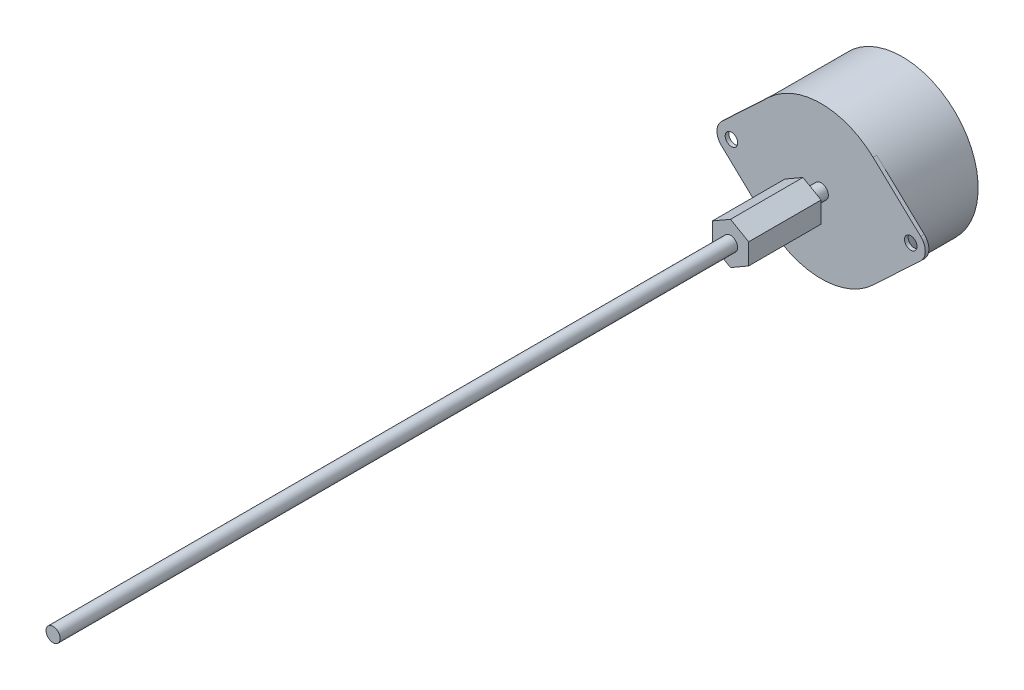
ISO-10303-21;
HEADER;
FILE_DESCRIPTION(('STEP AP214'),'2;1');
FILE_NAME('part.step','',(''),(''),'','','');
FILE_SCHEMA(('AUTOMOTIVE_DESIGN { 1 0 10303 214 1 1 1 1 }'));
ENDSEC;
DATA;
#1=APPLICATION_CONTEXT('core data for automotive mechanical design processes');
#2=APPLICATION_PROTOCOL_DEFINITION('international standard','automotive_design',2000,#1);
#3=PRODUCT_CONTEXT('',#1,'mechanical');
#4=PRODUCT('Part','Part','',(#3));
#5=PRODUCT_RELATED_PRODUCT_CATEGORY('part','',(#4));
#6=PRODUCT_DEFINITION_FORMATION('','',#4);
#7=PRODUCT_DEFINITION_CONTEXT('part definition',#1,'design');
#8=PRODUCT_DEFINITION('design','',#6,#7);
#9=PRODUCT_DEFINITION_SHAPE('','',#8);
#10=(LENGTH_UNIT() NAMED_UNIT(*) SI_UNIT(.MILLI.,.METRE.));
#11=(NAMED_UNIT(*) PLANE_ANGLE_UNIT() SI_UNIT($,.RADIAN.));
#12=(NAMED_UNIT(*) SI_UNIT($,.STERADIAN.) SOLID_ANGLE_UNIT());
#13=UNCERTAINTY_MEASURE_WITH_UNIT(LENGTH_MEASURE(1.E-05),#10,'distance_accuracy_value','');
#14=(GEOMETRIC_REPRESENTATION_CONTEXT(3) GLOBAL_UNCERTAINTY_ASSIGNED_CONTEXT((#13)) GLOBAL_UNIT_ASSIGNED_CONTEXT((#10,
#11,#12)) REPRESENTATION_CONTEXT('',''));
#15=CARTESIAN_POINT('',(0.,0.,0.));
#16=DIRECTION('',(0.,0.,1.));
#17=DIRECTION('',(1.,0.,0.));
#18=AXIS2_PLACEMENT_3D('',#15,#16,#17);
#19=CARTESIAN_POINT('',(0.,0.,-21.4));
#20=DIRECTION('',(0.,0.,1.));
#21=DIRECTION('',(1.,0.,0.));
#22=AXIS2_PLACEMENT_3D('',#19,#20,#21);
#23=PLANE('',#22);
#24=CARTESIAN_POINT('',(0.,0.,-21.4));
#25=DIRECTION('',(0.,0.,-1.));
#26=DIRECTION('',(1.,0.,0.));
#27=AXIS2_PLACEMENT_3D('',#24,#25,#26);
#28=CIRCLE('',#27,20.95);
#29=CARTESIAN_POINT('',(-20.95,0.,-21.4));
#30=VERTEX_POINT('',#29);
#31=EDGE_CURVE('E27',#30,#30,#28,.T.);
#32=ORIENTED_EDGE('',*,*,#31,.T.);
#33=EDGE_LOOP('',(#32));
#34=FACE_BOUND('',#33,.T.);
#35=ADVANCED_FACE('F16',(#34),#23,.F.);
#36=CARTESIAN_POINT('',(0.,0.,0.));
#37=DIRECTION('',(0.,0.,-1.));
#38=DIRECTION('',(1.,0.,0.));
#39=AXIS2_PLACEMENT_3D('',#36,#37,#38);
#40=CYLINDRICAL_SURFACE('',#39,20.95);
#41=ORIENTED_EDGE('',*,*,#31,.F.);
#42=DIRECTION('',(0.,0.,1.));
#43=VECTOR('',#42,1.);
#44=CARTESIAN_POINT('',(-20.95,0.,0.));
#45=LINE('',#44,#43);
#46=CARTESIAN_POINT('',(-20.95,0.,0.));
#47=VERTEX_POINT('',#46);
#48=EDGE_CURVE('E11',#30,#47,#45,.T.);
#49=ORIENTED_EDGE('',*,*,#48,.T.);
#50=CARTESIAN_POINT('',(0.,0.,0.));
#51=DIRECTION('',(0.,0.,1.));
#52=DIRECTION('',(1.,0.,0.));
#53=AXIS2_PLACEMENT_3D('',#50,#51,#52);
#54=CIRCLE('',#53,20.95);
#55=CARTESIAN_POINT('',(-14.3475757575758,15.2659611515497,0.));
#56=VERTEX_POINT('',#55);
#57=EDGE_CURVE('E304',#56,#47,#54,.T.);
#58=ORIENTED_EDGE('',*,*,#57,.F.);
#59=DIRECTION('',(0.,0.,1.));
#60=VECTOR('',#59,1.);
#61=CARTESIAN_POINT('',(-14.3475757575758,15.2659611515497,0.));
#62=LINE('',#61,#60);
#63=CARTESIAN_POINT('',(-14.3475757575758,15.2659611515497,1.));
#64=VERTEX_POINT('',#63);
#65=EDGE_CURVE('E197',#56,#64,#62,.T.);
#66=ORIENTED_EDGE('',*,*,#65,.T.);
#67=CARTESIAN_POINT('',(0.,0.,1.));
#68=DIRECTION('',(0.,0.,1.));
#69=DIRECTION('',(1.,0.,0.));
#70=AXIS2_PLACEMENT_3D('',#67,#68,#69);
#71=CIRCLE('',#70,20.95);
#72=CARTESIAN_POINT('',(14.3475757575758,15.2659611515497,1.));
#73=VERTEX_POINT('',#72);
#74=EDGE_CURVE('E327',#73,#64,#71,.T.);
#75=ORIENTED_EDGE('',*,*,#74,.F.);
#76=DIRECTION('',(0.,0.,1.));
#77=VECTOR('',#76,1.);
#78=CARTESIAN_POINT('',(14.3475757575758,15.2659611515497,0.));
#79=LINE('',#78,#77);
#80=CARTESIAN_POINT('',(14.3475757575758,15.2659611515497,0.));
#81=VERTEX_POINT('',#80);
#82=EDGE_CURVE('E311',#81,#73,#79,.T.);
#83=ORIENTED_EDGE('',*,*,#82,.F.);
#84=CARTESIAN_POINT('',(0.,0.,0.));
#85=DIRECTION('',(0.,0.,1.));
#86=DIRECTION('',(1.,0.,0.));
#87=AXIS2_PLACEMENT_3D('',#84,#85,#86);
#88=CIRCLE('',#87,20.95);
#89=CARTESIAN_POINT('',(14.3475757575758,-15.2659611515497,0.));
#90=VERTEX_POINT('',#89);
#91=EDGE_CURVE('E241',#90,#81,#88,.T.);
#92=ORIENTED_EDGE('',*,*,#91,.F.);
#93=DIRECTION('',(0.,0.,1.));
#94=VECTOR('',#93,1.);
#95=CARTESIAN_POINT('',(14.3475757575758,-15.2659611515497,0.));
#96=LINE('',#95,#94);
#97=CARTESIAN_POINT('',(14.3475757575758,-15.2659611515497,1.));
#98=VERTEX_POINT('',#97);
#99=EDGE_CURVE('E341',#90,#98,#96,.T.);
#100=ORIENTED_EDGE('',*,*,#99,.T.);
#101=CARTESIAN_POINT('',(0.,0.,1.));
#102=DIRECTION('',(0.,0.,1.));
#103=DIRECTION('',(1.,0.,0.));
#104=AXIS2_PLACEMENT_3D('',#101,#102,#103);
#105=CIRCLE('',#104,20.95);
#106=CARTESIAN_POINT('',(-14.3475757575758,-15.2659611515497,1.));
#107=VERTEX_POINT('',#106);
#108=EDGE_CURVE('E308',#107,#98,#105,.T.);
#109=ORIENTED_EDGE('',*,*,#108,.F.);
#110=DIRECTION('',(0.,0.,1.));
#111=VECTOR('',#110,1.);
#112=CARTESIAN_POINT('',(-14.3475757575758,-15.2659611515497,0.));
#113=LINE('',#112,#111);
#114=CARTESIAN_POINT('',(-14.3475757575758,-15.2659611515497,0.));
#115=VERTEX_POINT('',#114);
#116=EDGE_CURVE('E353',#115,#107,#113,.T.);
#117=ORIENTED_EDGE('',*,*,#116,.F.);
#118=CARTESIAN_POINT('',(0.,0.,0.));
#119=DIRECTION('',(0.,0.,1.));
#120=DIRECTION('',(1.,0.,0.));
#121=AXIS2_PLACEMENT_3D('',#118,#119,#120);
#122=CIRCLE('',#121,20.95);
#123=EDGE_CURVE('E307',#47,#115,#122,.T.);
#124=ORIENTED_EDGE('',*,*,#123,.F.);
#125=ORIENTED_EDGE('',*,*,#48,.F.);
#126=EDGE_LOOP('',(#41,#49,#58,#66,#75,#83,#92,#100,#109,#117,#124,#125));
#127=FACE_BOUND('',#126,.T.);
#128=ADVANCED_FACE('F433',(#127),#40,.T.);
#129=CARTESIAN_POINT('',(0.,0.,0.));
#130=DIRECTION('',(0.,0.,1.));
#131=DIRECTION('',(1.,0.,0.));
#132=AXIS2_PLACEMENT_3D('',#129,#130,#131);
#133=PLANE('',#132);
#134=CARTESIAN_POINT('',(-24.75,0.,0.));
#135=DIRECTION('',(0.,0.,-1.));
#136=DIRECTION('',(1.,0.,0.));
#137=AXIS2_PLACEMENT_3D('',#134,#135,#136);
#138=CIRCLE('',#137,1.725);
#139=CARTESIAN_POINT('',(-26.475,0.,0.));
#140=VERTEX_POINT('',#139);
#141=EDGE_CURVE('E276',#140,#140,#138,.T.);
#142=ORIENTED_EDGE('',*,*,#141,.F.);
#143=EDGE_LOOP('',(#142));
#144=FACE_BOUND('',#143,.T.);
#145=ORIENTED_EDGE('',*,*,#57,.T.);
#146=ORIENTED_EDGE('',*,*,#123,.T.);
#147=DIRECTION('',(0.728685496494019,-0.684848484848485,0.));
#148=VECTOR('',#147,1.);
#149=CARTESIAN_POINT('',(-27.4893939393939,-2.91474198597608,0.));
#150=LINE('',#149,#148);
#151=CARTESIAN_POINT('',(-27.4893939393939,-2.91474198597608,0.));
#152=VERTEX_POINT('',#151);
#153=EDGE_CURVE('E215',#152,#115,#150,.T.);
#154=ORIENTED_EDGE('',*,*,#153,.F.);
#155=CARTESIAN_POINT('',(-24.75,0.,0.));
#156=DIRECTION('',(0.,0.,1.));
#157=DIRECTION('',(-0.684848484848484,0.72868549649402,0.));
#158=AXIS2_PLACEMENT_3D('',#155,#156,#157);
#159=CIRCLE('',#158,4.);
#160=CARTESIAN_POINT('',(-27.4893939393939,2.91474198597607,0.));
#161=VERTEX_POINT('',#160);
#162=EDGE_CURVE('E207',#161,#152,#159,.T.);
#163=ORIENTED_EDGE('',*,*,#162,.F.);
#164=DIRECTION('',(-0.728685496494019,-0.684848484848485,0.));
#165=VECTOR('',#164,1.);
#166=CARTESIAN_POINT('',(-14.3475757575758,15.2659611515497,0.));
#167=LINE('',#166,#165);
#168=EDGE_CURVE('E190',#56,#161,#167,.T.);
#169=ORIENTED_EDGE('',*,*,#168,.F.);
#170=EDGE_LOOP('',(#145,#146,#154,#163,#169));
#171=FACE_BOUND('',#170,.T.);
#172=ADVANCED_FACE('F213',(#144,#171),#133,.F.);
#173=CARTESIAN_POINT('',(0.,0.,1.));
#174=DIRECTION('',(0.,0.,1.));
#175=DIRECTION('',(1.,0.,0.));
#176=AXIS2_PLACEMENT_3D('',#173,#174,#175);
#177=PLANE('',#176);
#178=CARTESIAN_POINT('',(24.75,0.,1.));
#179=DIRECTION('',(0.,0.,-1.));
#180=DIRECTION('',(1.,0.,0.));
#181=AXIS2_PLACEMENT_3D('',#178,#179,#180);
#182=CIRCLE('',#181,1.725);
#183=CARTESIAN_POINT('',(23.025,0.,1.));
#184=VERTEX_POINT('',#183);
#185=EDGE_CURVE('E322',#184,#184,#182,.T.);
#186=ORIENTED_EDGE('',*,*,#185,.T.);
#187=EDGE_LOOP('',(#186));
#188=FACE_BOUND('',#187,.T.);
#189=CARTESIAN_POINT('',(-24.75,0.,1.));
#190=DIRECTION('',(0.,0.,-1.));
#191=DIRECTION('',(1.,0.,0.));
#192=AXIS2_PLACEMENT_3D('',#189,#190,#191);
#193=CIRCLE('',#192,1.725);
#194=CARTESIAN_POINT('',(-26.475,0.,1.));
#195=VERTEX_POINT('',#194);
#196=EDGE_CURVE('E277',#195,#195,#193,.T.);
#197=ORIENTED_EDGE('',*,*,#196,.T.);
#198=EDGE_LOOP('',(#197));
#199=FACE_BOUND('',#198,.T.);
#200=CARTESIAN_POINT('',(0.,0.,1.));
#201=DIRECTION('',(0.,0.,-1.));
#202=DIRECTION('',(1.,0.,0.));
#203=AXIS2_PLACEMENT_3D('',#200,#201,#202);
#204=CIRCLE('',#203,2.);
#205=CARTESIAN_POINT('',(-2.,0.,1.));
#206=VERTEX_POINT('',#205);
#207=EDGE_CURVE('E292',#206,#206,#204,.T.);
#208=ORIENTED_EDGE('',*,*,#207,.T.);
#209=EDGE_LOOP('',(#208));
#210=FACE_BOUND('',#209,.T.);
#211=ORIENTED_EDGE('',*,*,#74,.T.);
#212=DIRECTION('',(-0.728685496494019,-0.684848484848485,0.));
#213=VECTOR('',#212,1.);
#214=CARTESIAN_POINT('',(-14.3475757575758,15.2659611515497,1.));
#215=LINE('',#214,#213);
#216=CARTESIAN_POINT('',(-27.4893939393939,2.91474198597607,1.));
#217=VERTEX_POINT('',#216);
#218=EDGE_CURVE('E202',#64,#217,#215,.T.);
#219=ORIENTED_EDGE('',*,*,#218,.T.);
#220=CARTESIAN_POINT('',(-24.75,0.,1.));
#221=DIRECTION('',(0.,0.,1.));
#222=DIRECTION('',(-0.684848484848484,0.72868549649402,0.));
#223=AXIS2_PLACEMENT_3D('',#220,#221,#222);
#224=CIRCLE('',#223,4.);
#225=CARTESIAN_POINT('',(-27.4893939393939,-2.91474198597608,1.));
#226=VERTEX_POINT('',#225);
#227=EDGE_CURVE('E209',#217,#226,#224,.T.);
#228=ORIENTED_EDGE('',*,*,#227,.T.);
#229=DIRECTION('',(0.728685496494019,-0.684848484848485,0.));
#230=VECTOR('',#229,1.);
#231=CARTESIAN_POINT('',(-27.4893939393939,-2.91474198597608,1.));
#232=LINE('',#231,#230);
#233=EDGE_CURVE('E225',#226,#107,#232,.T.);
#234=ORIENTED_EDGE('',*,*,#233,.T.);
#235=ORIENTED_EDGE('',*,*,#108,.T.);
#236=DIRECTION('',(0.728685496494019,0.684848484848485,0.));
#237=VECTOR('',#236,1.);
#238=CARTESIAN_POINT('',(27.4893939393939,-2.91474198597608,1.));
#239=LINE('',#238,#237);
#240=CARTESIAN_POINT('',(27.4893939393939,-2.91474198597608,1.));
#241=VERTEX_POINT('',#240);
#242=EDGE_CURVE('E270',#98,#241,#239,.T.);
#243=ORIENTED_EDGE('',*,*,#242,.T.);
#244=CARTESIAN_POINT('',(24.75,0.,1.));
#245=DIRECTION('',(0.,0.,1.));
#246=DIRECTION('',(0.684848484848484,-0.72868549649402,0.));
#247=AXIS2_PLACEMENT_3D('',#244,#245,#246);
#248=CIRCLE('',#247,4.);
#249=CARTESIAN_POINT('',(27.4893939393939,2.91474198597607,1.));
#250=VERTEX_POINT('',#249);
#251=EDGE_CURVE('E271',#241,#250,#248,.T.);
#252=ORIENTED_EDGE('',*,*,#251,.T.);
#253=DIRECTION('',(-0.728685496494019,0.684848484848485,0.));
#254=VECTOR('',#253,1.);
#255=CARTESIAN_POINT('',(14.3475757575758,15.2659611515497,1.));
#256=LINE('',#255,#254);
#257=EDGE_CURVE('E328',#250,#73,#256,.T.);
#258=ORIENTED_EDGE('',*,*,#257,.T.);
#259=EDGE_LOOP('',(#211,#219,#228,#234,#235,#243,#252,#258));
#260=FACE_BOUND('',#259,.T.);
#261=ADVANCED_FACE('F474',(#188,#199,#210,#260),#177,.T.);
#262=CARTESIAN_POINT('',(-14.3475757575758,15.2659611515497,0.));
#263=DIRECTION('',(-0.684848484848485,0.728685496494019,0.));
#264=DIRECTION('',(0.,0.,1.));
#265=AXIS2_PLACEMENT_3D('',#262,#263,#264);
#266=PLANE('',#265);
#267=ORIENTED_EDGE('',*,*,#168,.T.);
#268=DIRECTION('',(0.,0.,1.));
#269=VECTOR('',#268,1.);
#270=CARTESIAN_POINT('',(-27.4893939393939,2.91474198597607,0.));
#271=LINE('',#270,#269);
#272=EDGE_CURVE('E194',#161,#217,#271,.T.);
#273=ORIENTED_EDGE('',*,*,#272,.T.);
#274=ORIENTED_EDGE('',*,*,#218,.F.);
#275=ORIENTED_EDGE('',*,*,#65,.F.);
#276=EDGE_LOOP('',(#267,#273,#274,#275));
#277=FACE_BOUND('',#276,.T.);
#278=ADVANCED_FACE('F192',(#277),#266,.T.);
#279=CARTESIAN_POINT('',(-24.75,0.,0.));
#280=DIRECTION('',(0.,0.,1.));
#281=DIRECTION('',(-0.684848484848484,0.72868549649402,0.));
#282=AXIS2_PLACEMENT_3D('',#279,#280,#281);
#283=CYLINDRICAL_SURFACE('',#282,4.);
#284=ORIENTED_EDGE('',*,*,#162,.T.);
#285=DIRECTION('',(0.,0.,1.));
#286=VECTOR('',#285,1.);
#287=CARTESIAN_POINT('',(-27.4893939393939,-2.91474198597608,0.));
#288=LINE('',#287,#286);
#289=EDGE_CURVE('E217',#152,#226,#288,.T.);
#290=ORIENTED_EDGE('',*,*,#289,.T.);
#291=ORIENTED_EDGE('',*,*,#227,.F.);
#292=ORIENTED_EDGE('',*,*,#272,.F.);
#293=EDGE_LOOP('',(#284,#290,#291,#292));
#294=FACE_BOUND('',#293,.T.);
#295=ADVANCED_FACE('F205',(#294),#283,.T.);
#296=CARTESIAN_POINT('',(-27.4893939393939,-2.91474198597608,0.));
#297=DIRECTION('',(-0.684848484848485,-0.728685496494019,0.));
#298=DIRECTION('',(-0.728685496494019,0.684848484848485,0.));
#299=AXIS2_PLACEMENT_3D('',#296,#297,#298);
#300=PLANE('',#299);
#301=ORIENTED_EDGE('',*,*,#153,.T.);
#302=ORIENTED_EDGE('',*,*,#116,.T.);
#303=ORIENTED_EDGE('',*,*,#233,.F.);
#304=ORIENTED_EDGE('',*,*,#289,.F.);
#305=EDGE_LOOP('',(#301,#302,#303,#304));
#306=FACE_BOUND('',#305,.T.);
#307=ADVANCED_FACE('F478',(#306),#300,.T.);
#308=CARTESIAN_POINT('',(14.3475757575758,-15.2659611515497,0.));
#309=DIRECTION('',(0.684848484848485,-0.728685496494019,0.));
#310=DIRECTION('',(0.,0.,-1.));
#311=AXIS2_PLACEMENT_3D('',#308,#309,#310);
#312=PLANE('',#311);
#313=DIRECTION('',(-0.728685496494019,-0.684848484848485,0.));
#314=VECTOR('',#313,1.);
#315=CARTESIAN_POINT('',(27.4893939393939,-2.91474198597608,0.));
#316=LINE('',#315,#314);
#317=CARTESIAN_POINT('',(27.4893939393939,-2.91474198597608,0.));
#318=VERTEX_POINT('',#317);
#319=EDGE_CURVE('E287',#318,#90,#316,.T.);
#320=ORIENTED_EDGE('',*,*,#319,.F.);
#321=DIRECTION('',(0.,0.,1.));
#322=VECTOR('',#321,1.);
#323=CARTESIAN_POINT('',(27.4893939393939,-2.91474198597608,0.));
#324=LINE('',#323,#322);
#325=EDGE_CURVE('E266',#318,#241,#324,.T.);
#326=ORIENTED_EDGE('',*,*,#325,.T.);
#327=ORIENTED_EDGE('',*,*,#242,.F.);
#328=ORIENTED_EDGE('',*,*,#99,.F.);
#329=EDGE_LOOP('',(#320,#326,#327,#328));
#330=FACE_BOUND('',#329,.T.);
#331=ADVANCED_FACE('F476',(#330),#312,.T.);
#332=CARTESIAN_POINT('',(24.75,0.,0.));
#333=DIRECTION('',(0.,0.,1.));
#334=DIRECTION('',(0.684848484848484,-0.72868549649402,0.));
#335=AXIS2_PLACEMENT_3D('',#332,#333,#334);
#336=CYLINDRICAL_SURFACE('',#335,4.);
#337=CARTESIAN_POINT('',(24.75,0.,0.));
#338=DIRECTION('',(0.,0.,1.));
#339=DIRECTION('',(0.684848484848484,-0.72868549649402,0.));
#340=AXIS2_PLACEMENT_3D('',#337,#338,#339);
#341=CIRCLE('',#340,4.);
#342=CARTESIAN_POINT('',(27.4893939393939,2.91474198597607,0.));
#343=VERTEX_POINT('',#342);
#344=EDGE_CURVE('E240',#318,#343,#341,.T.);
#345=ORIENTED_EDGE('',*,*,#344,.T.);
#346=DIRECTION('',(0.,0.,1.));
#347=VECTOR('',#346,1.);
#348=CARTESIAN_POINT('',(27.4893939393939,2.91474198597607,0.));
#349=LINE('',#348,#347);
#350=EDGE_CURVE('E319',#343,#250,#349,.T.);
#351=ORIENTED_EDGE('',*,*,#350,.T.);
#352=ORIENTED_EDGE('',*,*,#251,.F.);
#353=ORIENTED_EDGE('',*,*,#325,.F.);
#354=EDGE_LOOP('',(#345,#351,#352,#353));
#355=FACE_BOUND('',#354,.T.);
#356=ADVANCED_FACE('F428',(#355),#336,.T.);
#357=CARTESIAN_POINT('',(27.4893939393939,2.91474198597608,0.));
#358=DIRECTION('',(0.684848484848485,0.728685496494019,0.));
#359=DIRECTION('',(0.,0.,-1.));
#360=AXIS2_PLACEMENT_3D('',#357,#358,#359);
#361=PLANE('',#360);
#362=DIRECTION('',(0.728685496494019,-0.684848484848485,0.));
#363=VECTOR('',#362,1.);
#364=CARTESIAN_POINT('',(14.3475757575758,15.2659611515497,0.));
#365=LINE('',#364,#363);
#366=EDGE_CURVE('E236',#81,#343,#365,.T.);
#367=ORIENTED_EDGE('',*,*,#366,.F.);
#368=ORIENTED_EDGE('',*,*,#82,.T.);
#369=ORIENTED_EDGE('',*,*,#257,.F.);
#370=ORIENTED_EDGE('',*,*,#350,.F.);
#371=EDGE_LOOP('',(#367,#368,#369,#370));
#372=FACE_BOUND('',#371,.T.);
#373=ADVANCED_FACE('F424',(#372),#361,.T.);
#374=CARTESIAN_POINT('',(-24.75,0.,0.));
#375=DIRECTION('',(0.,0.,1.));
#376=DIRECTION('',(1.,0.,0.));
#377=AXIS2_PLACEMENT_3D('',#374,#375,#376);
#378=CYLINDRICAL_SURFACE('',#377,1.725);
#379=ORIENTED_EDGE('',*,*,#196,.F.);
#380=DIRECTION('',(0.,0.,-1.));
#381=VECTOR('',#380,1.);
#382=CARTESIAN_POINT('',(-26.475,0.,0.));
#383=LINE('',#382,#381);
#384=EDGE_CURVE('E153',#195,#140,#383,.T.);
#385=ORIENTED_EDGE('',*,*,#384,.T.);
#386=ORIENTED_EDGE('',*,*,#141,.T.);
#387=ORIENTED_EDGE('',*,*,#384,.F.);
#388=EDGE_LOOP('',(#379,#385,#386,#387));
#389=FACE_BOUND('',#388,.T.);
#390=ADVANCED_FACE('F497',(#389),#378,.F.);
#391=CARTESIAN_POINT('',(24.75,0.,0.));
#392=DIRECTION('',(0.,0.,1.));
#393=DIRECTION('',(1.,0.,0.));
#394=AXIS2_PLACEMENT_3D('',#391,#392,#393);
#395=CYLINDRICAL_SURFACE('',#394,1.725);
#396=ORIENTED_EDGE('',*,*,#185,.F.);
#397=DIRECTION('',(0.,0.,-1.));
#398=VECTOR('',#397,1.);
#399=CARTESIAN_POINT('',(23.025,0.,0.));
#400=LINE('',#399,#398);
#401=CARTESIAN_POINT('',(23.025,0.,0.));
#402=VERTEX_POINT('',#401);
#403=EDGE_CURVE('E140',#184,#402,#400,.T.);
#404=ORIENTED_EDGE('',*,*,#403,.T.);
#405=CARTESIAN_POINT('',(24.75,0.,0.));
#406=DIRECTION('',(0.,0.,-1.));
#407=DIRECTION('',(1.,0.,0.));
#408=AXIS2_PLACEMENT_3D('',#405,#406,#407);
#409=CIRCLE('',#408,1.725);
#410=EDGE_CURVE('E291',#402,#402,#409,.T.);
#411=ORIENTED_EDGE('',*,*,#410,.T.);
#412=ORIENTED_EDGE('',*,*,#403,.F.);
#413=EDGE_LOOP('',(#396,#404,#411,#412));
#414=FACE_BOUND('',#413,.T.);
#415=ADVANCED_FACE('F499',(#414),#395,.F.);
#416=CARTESIAN_POINT('',(0.,0.,0.));
#417=DIRECTION('',(0.,0.,1.));
#418=DIRECTION('',(1.,0.,0.));
#419=AXIS2_PLACEMENT_3D('',#416,#417,#418);
#420=PLANE('',#419);
#421=ORIENTED_EDGE('',*,*,#410,.F.);
#422=EDGE_LOOP('',(#421));
#423=FACE_BOUND('',#422,.T.);
#424=ORIENTED_EDGE('',*,*,#91,.T.);
#425=ORIENTED_EDGE('',*,*,#366,.T.);
#426=ORIENTED_EDGE('',*,*,#344,.F.);
#427=ORIENTED_EDGE('',*,*,#319,.T.);
#428=EDGE_LOOP('',(#424,#425,#426,#427));
#429=FACE_BOUND('',#428,.T.);
#430=ADVANCED_FACE('F431',(#423,#429),#420,.F.);
#431=CARTESIAN_POINT('',(0.,0.,213.));
#432=DIRECTION('',(0.,0.,1.));
#433=DIRECTION('',(1.,0.,0.));
#434=AXIS2_PLACEMENT_3D('',#431,#432,#433);
#435=PLANE('',#434);
#436=CARTESIAN_POINT('',(0.,0.,213.));
#437=DIRECTION('',(0.,0.,1.));
#438=DIRECTION('',(1.,0.,0.));
#439=AXIS2_PLACEMENT_3D('',#436,#437,#438);
#440=CIRCLE('',#439,1.954);
#441=CARTESIAN_POINT('',(-1.954,0.,213.));
#442=VERTEX_POINT('',#441);
#443=EDGE_CURVE('E295',#442,#442,#440,.T.);
#444=ORIENTED_EDGE('',*,*,#443,.T.);
#445=EDGE_LOOP('',(#444));
#446=FACE_BOUND('',#445,.T.);
#447=ADVANCED_FACE('F532',(#446),#435,.T.);
#448=CARTESIAN_POINT('',(0.,0.,1.));
#449=DIRECTION('',(0.,0.,1.));
#450=DIRECTION('',(1.,0.,0.));
#451=AXIS2_PLACEMENT_3D('',#448,#449,#450);
#452=CYLINDRICAL_SURFACE('',#451,1.954);
#453=ORIENTED_EDGE('',*,*,#443,.F.);
#454=DIRECTION('',(0.,0.,-1.));
#455=VECTOR('',#454,1.);
#456=CARTESIAN_POINT('',(-1.954,0.,1.));
#457=LINE('',#456,#455);
#458=CARTESIAN_POINT('',(-1.954,0.,26.));
#459=VERTEX_POINT('',#458);
#460=EDGE_CURVE('E345',#442,#459,#457,.T.);
#461=ORIENTED_EDGE('',*,*,#460,.T.);
#462=CARTESIAN_POINT('',(0.,0.,26.));
#463=DIRECTION('',(0.,0.,1.));
#464=DIRECTION('',(1.,0.,0.));
#465=AXIS2_PLACEMENT_3D('',#462,#463,#464);
#466=CIRCLE('',#465,1.954);
#467=EDGE_CURVE('E242',#459,#459,#466,.T.);
#468=ORIENTED_EDGE('',*,*,#467,.T.);
#469=ORIENTED_EDGE('',*,*,#460,.F.);
#470=EDGE_LOOP('',(#453,#461,#468,#469));
#471=FACE_BOUND('',#470,.T.);
#472=ADVANCED_FACE('F525',(#471),#452,.T.);
#473=CARTESIAN_POINT('',(0.,0.,1.));
#474=DIRECTION('',(0.,0.,1.));
#475=DIRECTION('',(1.,0.,0.));
#476=AXIS2_PLACEMENT_3D('',#473,#474,#475);
#477=CYLINDRICAL_SURFACE('',#476,2.);
#478=CARTESIAN_POINT('',(0.,0.,6.));
#479=DIRECTION('',(0.,0.,-1.));
#480=DIRECTION('',(1.,0.,0.));
#481=AXIS2_PLACEMENT_3D('',#478,#479,#480);
#482=CIRCLE('',#481,2.);
#483=CARTESIAN_POINT('',(-2.,0.,6.));
#484=VERTEX_POINT('',#483);
#485=EDGE_CURVE('E246',#484,#484,#482,.T.);
#486=ORIENTED_EDGE('',*,*,#485,.T.);
#487=DIRECTION('',(0.,0.,-1.));
#488=VECTOR('',#487,1.);
#489=CARTESIAN_POINT('',(-2.,0.,1.));
#490=LINE('',#489,#488);
#491=EDGE_CURVE('E254',#484,#206,#490,.T.);
#492=ORIENTED_EDGE('',*,*,#491,.T.);
#493=ORIENTED_EDGE('',*,*,#207,.F.);
#494=ORIENTED_EDGE('',*,*,#491,.F.);
#495=EDGE_LOOP('',(#486,#492,#493,#494));
#496=FACE_BOUND('',#495,.T.);
#497=ADVANCED_FACE('F512',(#496),#477,.T.);
#498=CARTESIAN_POINT('',(0.,0.,6.));
#499=DIRECTION('',(0.,0.,1.));
#500=DIRECTION('',(1.,0.,0.));
#501=AXIS2_PLACEMENT_3D('',#498,#499,#500);
#502=PLANE('',#501);
#503=ORIENTED_EDGE('',*,*,#485,.F.);
#504=EDGE_LOOP('',(#503));
#505=FACE_BOUND('',#504,.T.);
#506=DIRECTION('',(-0.866025403784439,-0.5,0.));
#507=VECTOR('',#506,1.);
#508=CARTESIAN_POINT('',(1.25,-5.05181485540923,6.));
#509=LINE('',#508,#507);
#510=CARTESIAN_POINT('',(5.,-2.88675134594813,6.));
#511=VERTEX_POINT('',#510);
#512=CARTESIAN_POINT('',(0.,-5.77350269189626,6.));
#513=VERTEX_POINT('',#512);
#514=EDGE_CURVE('E265',#511,#513,#509,.T.);
#515=ORIENTED_EDGE('',*,*,#514,.T.);
#516=DIRECTION('',(-0.866025403784439,0.5,0.));
#517=VECTOR('',#516,1.);
#518=CARTESIAN_POINT('',(-3.75,-3.60843918243516,6.));
#519=LINE('',#518,#517);
#520=CARTESIAN_POINT('',(-5.,-2.88675134594813,6.));
#521=VERTEX_POINT('',#520);
#522=EDGE_CURVE('E251',#513,#521,#519,.T.);
#523=ORIENTED_EDGE('',*,*,#522,.T.);
#524=DIRECTION('',(0.,1.,0.));
#525=VECTOR('',#524,1.);
#526=CARTESIAN_POINT('',(-5.,1.44337567297406,6.));
#527=LINE('',#526,#525);
#528=CARTESIAN_POINT('',(-5.,2.88675134594813,6.));
#529=VERTEX_POINT('',#528);
#530=EDGE_CURVE('E279',#521,#529,#527,.T.);
#531=ORIENTED_EDGE('',*,*,#530,.T.);
#532=DIRECTION('',(0.866025403784438,0.5,0.));
#533=VECTOR('',#532,1.);
#534=CARTESIAN_POINT('',(-1.25,5.05181485540923,6.));
#535=LINE('',#534,#533);
#536=CARTESIAN_POINT('',(0.,5.77350269189626,6.));
#537=VERTEX_POINT('',#536);
#538=EDGE_CURVE('E296',#529,#537,#535,.T.);
#539=ORIENTED_EDGE('',*,*,#538,.T.);
#540=DIRECTION('',(0.866025403784439,-0.5,0.));
#541=VECTOR('',#540,1.);
#542=CARTESIAN_POINT('',(3.75,3.60843918243516,6.));
#543=LINE('',#542,#541);
#544=CARTESIAN_POINT('',(5.,2.88675134594813,6.));
#545=VERTEX_POINT('',#544);
#546=EDGE_CURVE('E256',#537,#545,#543,.T.);
#547=ORIENTED_EDGE('',*,*,#546,.T.);
#548=DIRECTION('',(0.,-1.,0.));
#549=VECTOR('',#548,1.);
#550=CARTESIAN_POINT('',(5.,-1.44337567297406,6.));
#551=LINE('',#550,#549);
#552=EDGE_CURVE('E335',#545,#511,#551,.T.);
#553=ORIENTED_EDGE('',*,*,#552,.T.);
#554=EDGE_LOOP('',(#515,#523,#531,#539,#547,#553));
#555=FACE_BOUND('',#554,.T.);
#556=ADVANCED_FACE('F398',(#505,#555),#502,.F.);
#557=CARTESIAN_POINT('',(0.,0.,26.));
#558=DIRECTION('',(0.,0.,1.));
#559=DIRECTION('',(1.,0.,0.));
#560=AXIS2_PLACEMENT_3D('',#557,#558,#559);
#561=PLANE('',#560);
#562=ORIENTED_EDGE('',*,*,#467,.F.);
#563=EDGE_LOOP('',(#562));
#564=FACE_BOUND('',#563,.T.);
#565=DIRECTION('',(0.866025403784439,0.5,0.));
#566=VECTOR('',#565,1.);
#567=CARTESIAN_POINT('',(1.25,-5.05181485540923,26.));
#568=LINE('',#567,#566);
#569=CARTESIAN_POINT('',(0.,-5.77350269189626,26.));
#570=VERTEX_POINT('',#569);
#571=CARTESIAN_POINT('',(5.,-2.88675134594813,26.));
#572=VERTEX_POINT('',#571);
#573=EDGE_CURVE('E247',#570,#572,#568,.T.);
#574=ORIENTED_EDGE('',*,*,#573,.T.);
#575=DIRECTION('',(0.,1.,0.));
#576=VECTOR('',#575,1.);
#577=CARTESIAN_POINT('',(5.,-1.44337567297406,26.));
#578=LINE('',#577,#576);
#579=CARTESIAN_POINT('',(5.,2.88675134594813,26.));
#580=VERTEX_POINT('',#579);
#581=EDGE_CURVE('E20',#572,#580,#578,.T.);
#582=ORIENTED_EDGE('',*,*,#581,.T.);
#583=DIRECTION('',(-0.866025403784439,0.5,0.));
#584=VECTOR('',#583,1.);
#585=CARTESIAN_POINT('',(3.75,3.60843918243516,26.));
#586=LINE('',#585,#584);
#587=CARTESIAN_POINT('',(0.,5.77350269189626,26.));
#588=VERTEX_POINT('',#587);
#589=EDGE_CURVE('E260',#580,#588,#586,.T.);
#590=ORIENTED_EDGE('',*,*,#589,.T.);
#591=DIRECTION('',(-0.866025403784438,-0.5,0.));
#592=VECTOR('',#591,1.);
#593=CARTESIAN_POINT('',(-1.25,5.05181485540923,26.));
#594=LINE('',#593,#592);
#595=CARTESIAN_POINT('',(-5.,2.88675134594813,26.));
#596=VERTEX_POINT('',#595);
#597=EDGE_CURVE('E229',#588,#596,#594,.T.);
#598=ORIENTED_EDGE('',*,*,#597,.T.);
#599=DIRECTION('',(0.,-1.,0.));
#600=VECTOR('',#599,1.);
#601=CARTESIAN_POINT('',(-5.,1.44337567297406,26.));
#602=LINE('',#601,#600);
#603=CARTESIAN_POINT('',(-5.,-2.88675134594813,26.));
#604=VERTEX_POINT('',#603);
#605=EDGE_CURVE('E283',#596,#604,#602,.T.);
#606=ORIENTED_EDGE('',*,*,#605,.T.);
#607=DIRECTION('',(0.866025403784439,-0.5,0.));
#608=VECTOR('',#607,1.);
#609=CARTESIAN_POINT('',(-3.75,-3.60843918243516,26.));
#610=LINE('',#609,#608);
#611=EDGE_CURVE('E230',#604,#570,#610,.T.);
#612=ORIENTED_EDGE('',*,*,#611,.T.);
#613=EDGE_LOOP('',(#574,#582,#590,#598,#606,#612));
#614=FACE_BOUND('',#613,.T.);
#615=ADVANCED_FACE('F516',(#564,#614),#561,.T.);
#616=CARTESIAN_POINT('',(0.,-5.77350269189626,6.));
#617=DIRECTION('',(0.5,-0.866025403784439,0.));
#618=DIRECTION('',(0.,0.,-1.));
#619=AXIS2_PLACEMENT_3D('',#616,#617,#618);
#620=PLANE('',#619);
#621=ORIENTED_EDGE('',*,*,#514,.F.);
#622=DIRECTION('',(0.,0.,1.));
#623=VECTOR('',#622,1.);
#624=CARTESIAN_POINT('',(5.,-2.88675134594813,6.));
#625=LINE('',#624,#623);
#626=EDGE_CURVE('E300',#511,#572,#625,.T.);
#627=ORIENTED_EDGE('',*,*,#626,.T.);
#628=ORIENTED_EDGE('',*,*,#573,.F.);
#629=DIRECTION('',(0.,0.,1.));
#630=VECTOR('',#629,1.);
#631=CARTESIAN_POINT('',(0.,-5.77350269189626,6.));
#632=LINE('',#631,#630);
#633=EDGE_CURVE('E235',#513,#570,#632,.T.);
#634=ORIENTED_EDGE('',*,*,#633,.F.);
#635=EDGE_LOOP('',(#621,#627,#628,#634));
#636=FACE_BOUND('',#635,.T.);
#637=ADVANCED_FACE('F522',(#636),#620,.T.);
#638=CARTESIAN_POINT('',(5.,-2.88675134594813,6.));
#639=DIRECTION('',(1.,0.,0.));
#640=DIRECTION('',(0.,1.,0.));
#641=AXIS2_PLACEMENT_3D('',#638,#639,#640);
#642=PLANE('',#641);
#643=ORIENTED_EDGE('',*,*,#552,.F.);
#644=DIRECTION('',(0.,0.,1.));
#645=VECTOR('',#644,1.);
#646=CARTESIAN_POINT('',(5.,2.88675134594813,6.));
#647=LINE('',#646,#645);
#648=EDGE_CURVE('E274',#545,#580,#647,.T.);
#649=ORIENTED_EDGE('',*,*,#648,.T.);
#650=ORIENTED_EDGE('',*,*,#581,.F.);
#651=ORIENTED_EDGE('',*,*,#626,.F.);
#652=EDGE_LOOP('',(#643,#649,#650,#651));
#653=FACE_BOUND('',#652,.T.);
#654=ADVANCED_FACE('F529',(#653),#642,.T.);
#655=CARTESIAN_POINT('',(5.,2.88675134594813,6.));
#656=DIRECTION('',(0.5,0.866025403784439,0.));
#657=DIRECTION('',(0.,0.,-1.));
#658=AXIS2_PLACEMENT_3D('',#655,#656,#657);
#659=PLANE('',#658);
#660=ORIENTED_EDGE('',*,*,#546,.F.);
#661=DIRECTION('',(0.,0.,1.));
#662=VECTOR('',#661,1.);
#663=CARTESIAN_POINT('',(0.,5.77350269189626,6.));
#664=LINE('',#663,#662);
#665=EDGE_CURVE('E261',#537,#588,#664,.T.);
#666=ORIENTED_EDGE('',*,*,#665,.T.);
#667=ORIENTED_EDGE('',*,*,#589,.F.);
#668=ORIENTED_EDGE('',*,*,#648,.F.);
#669=EDGE_LOOP('',(#660,#666,#667,#668));
#670=FACE_BOUND('',#669,.T.);
#671=ADVANCED_FACE('F541',(#670),#659,.T.);
#672=CARTESIAN_POINT('',(0.,5.77350269189626,6.));
#673=DIRECTION('',(-0.5,0.866025403784438,0.));
#674=DIRECTION('',(0.,0.,1.));
#675=AXIS2_PLACEMENT_3D('',#672,#673,#674);
#676=PLANE('',#675);
#677=ORIENTED_EDGE('',*,*,#538,.F.);
#678=DIRECTION('',(0.,0.,1.));
#679=VECTOR('',#678,1.);
#680=CARTESIAN_POINT('',(-5.,2.88675134594813,6.));
#681=LINE('',#680,#679);
#682=EDGE_CURVE('E286',#529,#596,#681,.T.);
#683=ORIENTED_EDGE('',*,*,#682,.T.);
#684=ORIENTED_EDGE('',*,*,#597,.F.);
#685=ORIENTED_EDGE('',*,*,#665,.F.);
#686=EDGE_LOOP('',(#677,#683,#684,#685));
#687=FACE_BOUND('',#686,.T.);
#688=ADVANCED_FACE('F18',(#687),#676,.T.);
#689=CARTESIAN_POINT('',(-5.,2.88675134594813,6.));
#690=DIRECTION('',(-1.,0.,0.));
#691=DIRECTION('',(0.,1.,0.));
#692=AXIS2_PLACEMENT_3D('',#689,#690,#691);
#693=PLANE('',#692);
#694=ORIENTED_EDGE('',*,*,#530,.F.);
#695=DIRECTION('',(0.,0.,1.));
#696=VECTOR('',#695,1.);
#697=CARTESIAN_POINT('',(-5.,-2.88675134594813,6.));
#698=LINE('',#697,#696);
#699=EDGE_CURVE('E234',#521,#604,#698,.T.);
#700=ORIENTED_EDGE('',*,*,#699,.T.);
#701=ORIENTED_EDGE('',*,*,#605,.F.);
#702=ORIENTED_EDGE('',*,*,#682,.F.);
#703=EDGE_LOOP('',(#694,#700,#701,#702));
#704=FACE_BOUND('',#703,.T.);
#705=ADVANCED_FACE('F406',(#704),#693,.T.);
#706=CARTESIAN_POINT('',(-5.,-2.88675134594813,6.));
#707=DIRECTION('',(-0.5,-0.866025403784439,0.));
#708=DIRECTION('',(-0.866025403784439,0.5,0.));
#709=AXIS2_PLACEMENT_3D('',#706,#707,#708);
#710=PLANE('',#709);
#711=ORIENTED_EDGE('',*,*,#522,.F.);
#712=ORIENTED_EDGE('',*,*,#633,.T.);
#713=ORIENTED_EDGE('',*,*,#611,.F.);
#714=ORIENTED_EDGE('',*,*,#699,.F.);
#715=EDGE_LOOP('',(#711,#712,#713,#714));
#716=FACE_BOUND('',#715,.T.);
#717=ADVANCED_FACE('F402',(#716),#710,.T.);
#718=CLOSED_SHELL('',(#35,#128,#172,#261,#278,#295,#307,#331,#356,#373,#390,#415,#430,#447,#472,
#497,#556,#615,#637,#654,#671,#688,#705,#717));
#719=MANIFOLD_SOLID_BREP('B1',#718);
#720=ADVANCED_BREP_SHAPE_REPRESENTATION('',(#18,#719),#14);
#721=SHAPE_DEFINITION_REPRESENTATION(#9,#720);
ENDSEC;
END-ISO-10303-21;
